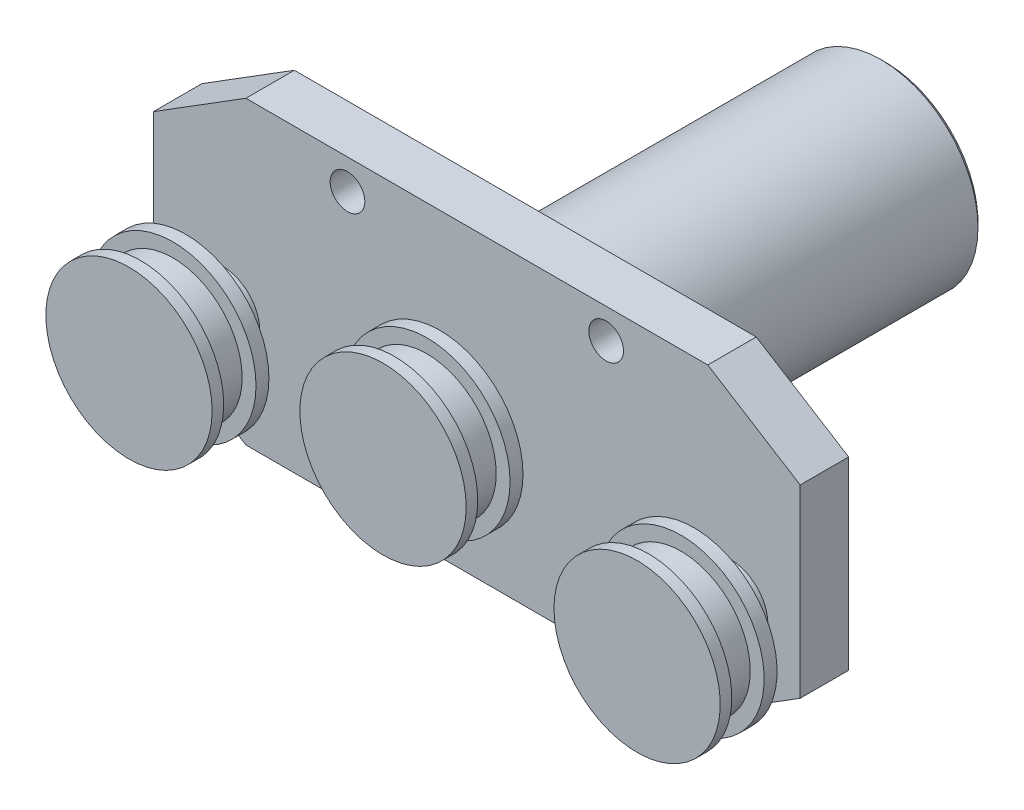
ISO-10303-21;
HEADER;
FILE_DESCRIPTION(('STEP AP214'),'2;1');
FILE_NAME('part.step','',(''),(''),'','','');
FILE_SCHEMA(('AUTOMOTIVE_DESIGN { 1 0 10303 214 1 1 1 1 }'));
ENDSEC;
DATA;
#1=APPLICATION_CONTEXT('core data for automotive mechanical design processes');
#2=APPLICATION_PROTOCOL_DEFINITION('international standard','automotive_design',2000,#1);
#3=PRODUCT_CONTEXT('',#1,'mechanical');
#4=PRODUCT('Part','Part','',(#3));
#5=PRODUCT_RELATED_PRODUCT_CATEGORY('part','',(#4));
#6=PRODUCT_DEFINITION_FORMATION('','',#4);
#7=PRODUCT_DEFINITION_CONTEXT('part definition',#1,'design');
#8=PRODUCT_DEFINITION('design','',#6,#7);
#9=PRODUCT_DEFINITION_SHAPE('','',#8);
#10=(LENGTH_UNIT() NAMED_UNIT(*) SI_UNIT(.MILLI.,.METRE.));
#11=(NAMED_UNIT(*) PLANE_ANGLE_UNIT() SI_UNIT($,.RADIAN.));
#12=(NAMED_UNIT(*) SI_UNIT($,.STERADIAN.) SOLID_ANGLE_UNIT());
#13=UNCERTAINTY_MEASURE_WITH_UNIT(LENGTH_MEASURE(1.E-05),#10,'distance_accuracy_value','');
#14=(GEOMETRIC_REPRESENTATION_CONTEXT(3) GLOBAL_UNCERTAINTY_ASSIGNED_CONTEXT((#13)) GLOBAL_UNIT_ASSIGNED_CONTEXT((#10,
#11,#12)) REPRESENTATION_CONTEXT('',''));
#15=CARTESIAN_POINT('',(0.,0.,0.));
#16=DIRECTION('',(0.,0.,1.));
#17=DIRECTION('',(1.,0.,0.));
#18=AXIS2_PLACEMENT_3D('',#15,#16,#17);
#19=CARTESIAN_POINT('',(-30.,-9.49999999999998,30.8));
#20=DIRECTION('',(0.,0.,-1.));
#21=DIRECTION('',(-1.,0.,0.));
#22=AXIS2_PLACEMENT_3D('',#19,#20,#21);
#23=CYLINDRICAL_SURFACE('',#22,18.);
#24=CARTESIAN_POINT('',(-30.,-9.49999999999998,18.5));
#25=DIRECTION('',(0.,0.,1.));
#26=DIRECTION('',(1.,0.,0.));
#27=AXIS2_PLACEMENT_3D('',#24,#25,#26);
#28=CIRCLE('',#27,18.);
#29=CARTESIAN_POINT('',(-12.,-9.49999999999998,18.5));
#30=VERTEX_POINT('',#29);
#31=EDGE_CURVE('E347',#30,#30,#28,.T.);
#32=ORIENTED_EDGE('',*,*,#31,.T.);
#33=EDGE_LOOP('',(#32));
#34=FACE_BOUND('',#33,.T.);
#35=CARTESIAN_POINT('',(-30.,-9.49999999999998,21.3));
#36=DIRECTION('',(0.,0.,1.));
#37=DIRECTION('',(1.,0.,0.));
#38=AXIS2_PLACEMENT_3D('',#35,#36,#37);
#39=CIRCLE('',#38,18.);
#40=CARTESIAN_POINT('',(-12.,-9.49999999999998,21.3));
#41=VERTEX_POINT('',#40);
#42=EDGE_CURVE('E260',#41,#41,#39,.T.);
#43=ORIENTED_EDGE('',*,*,#42,.F.);
#44=EDGE_LOOP('',(#43));
#45=FACE_BOUND('',#44,.T.);
#46=ADVANCED_FACE('F48',(#34,#45),#23,.T.);
#47=CARTESIAN_POINT('',(25.,0.,30.8));
#48=DIRECTION('',(0.,0.,-1.));
#49=DIRECTION('',(-1.,0.,0.));
#50=AXIS2_PLACEMENT_3D('',#47,#48,#49);
#51=CYLINDRICAL_SURFACE('',#50,18.);
#52=CARTESIAN_POINT('',(25.,0.,18.5));
#53=DIRECTION('',(0.,0.,1.));
#54=DIRECTION('',(1.,0.,0.));
#55=AXIS2_PLACEMENT_3D('',#52,#53,#54);
#56=CIRCLE('',#55,18.);
#57=CARTESIAN_POINT('',(43.,0.,18.5));
#58=VERTEX_POINT('',#57);
#59=EDGE_CURVE('E351',#58,#58,#56,.T.);
#60=ORIENTED_EDGE('',*,*,#59,.T.);
#61=EDGE_LOOP('',(#60));
#62=FACE_BOUND('',#61,.T.);
#63=CARTESIAN_POINT('',(25.,0.,21.3));
#64=DIRECTION('',(0.,0.,1.));
#65=DIRECTION('',(1.,0.,0.));
#66=AXIS2_PLACEMENT_3D('',#63,#64,#65);
#67=CIRCLE('',#66,18.);
#68=CARTESIAN_POINT('',(43.,0.,21.3));
#69=VERTEX_POINT('',#68);
#70=EDGE_CURVE('E256',#69,#69,#67,.T.);
#71=ORIENTED_EDGE('',*,*,#70,.F.);
#72=EDGE_LOOP('',(#71));
#73=FACE_BOUND('',#72,.T.);
#74=ADVANCED_FACE('F311',(#62,#73),#51,.T.);
#75=CARTESIAN_POINT('',(-3.00000000000001,-26.,10.5));
#76=DIRECTION('',(0.,0.,-1.));
#77=DIRECTION('',(-1.,0.,0.));
#78=AXIS2_PLACEMENT_3D('',#75,#76,#77);
#79=CYLINDRICAL_SURFACE('',#78,2.25);
#80=CARTESIAN_POINT('',(-3.00000000000001,-26.,0.));
#81=DIRECTION('',(0.,0.,1.));
#82=DIRECTION('',(1.,0.,0.));
#83=AXIS2_PLACEMENT_3D('',#80,#81,#82);
#84=CIRCLE('',#83,2.25);
#85=CARTESIAN_POINT('',(-0.750000000000005,-26.,0.));
#86=VERTEX_POINT('',#85);
#87=EDGE_CURVE('E195',#86,#86,#84,.F.);
#88=ORIENTED_EDGE('',*,*,#87,.T.);
#89=EDGE_LOOP('',(#88));
#90=FACE_BOUND('',#89,.T.);
#91=CARTESIAN_POINT('',(-3.00000000000001,-26.,4.5));
#92=DIRECTION('',(0.,0.,1.));
#93=DIRECTION('',(1.,0.,0.));
#94=AXIS2_PLACEMENT_3D('',#91,#92,#93);
#95=CIRCLE('',#94,2.25);
#96=CARTESIAN_POINT('',(-0.750000000000005,-26.,4.5));
#97=VERTEX_POINT('',#96);
#98=EDGE_CURVE('E241',#97,#97,#95,.F.);
#99=ORIENTED_EDGE('',*,*,#98,.F.);
#100=EDGE_LOOP('',(#99));
#101=FACE_BOUND('',#100,.T.);
#102=ADVANCED_FACE('F319',(#90,#101),#79,.F.);
#103=CARTESIAN_POINT('',(53.,26.,10.5));
#104=DIRECTION('',(0.,0.,-1.));
#105=DIRECTION('',(-1.,0.,0.));
#106=AXIS2_PLACEMENT_3D('',#103,#104,#105);
#107=CYLINDRICAL_SURFACE('',#106,2.25);
#108=CARTESIAN_POINT('',(53.,26.,0.));
#109=DIRECTION('',(0.,0.,-1.));
#110=DIRECTION('',(-1.,0.,0.));
#111=AXIS2_PLACEMENT_3D('',#108,#109,#110);
#112=CIRCLE('',#111,2.25);
#113=CARTESIAN_POINT('',(50.75,26.,0.));
#114=VERTEX_POINT('',#113);
#115=EDGE_CURVE('E158',#114,#114,#112,.T.);
#116=ORIENTED_EDGE('',*,*,#115,.T.);
#117=EDGE_LOOP('',(#116));
#118=FACE_BOUND('',#117,.T.);
#119=CARTESIAN_POINT('',(53.,26.,4.5));
#120=DIRECTION('',(0.,0.,1.));
#121=DIRECTION('',(1.,0.,0.));
#122=AXIS2_PLACEMENT_3D('',#119,#120,#121);
#123=CIRCLE('',#122,2.25);
#124=CARTESIAN_POINT('',(55.25,26.,4.5));
#125=VERTEX_POINT('',#124);
#126=EDGE_CURVE('E236',#125,#125,#123,.F.);
#127=ORIENTED_EDGE('',*,*,#126,.F.);
#128=EDGE_LOOP('',(#127));
#129=FACE_BOUND('',#128,.T.);
#130=ADVANCED_FACE('F427',(#118,#129),#107,.F.);
#131=CARTESIAN_POINT('',(0.,32.5,10.5));
#132=DIRECTION('',(0.,1.,0.));
#133=DIRECTION('',(0.,0.,1.));
#134=AXIS2_PLACEMENT_3D('',#131,#132,#133);
#135=PLANE('',#134);
#136=DIRECTION('',(1.,0.,0.));
#137=VECTOR('',#136,1.);
#138=CARTESIAN_POINT('',(0.,32.5,0.));
#139=LINE('',#138,#137);
#140=CARTESIAN_POINT('',(-25.,32.5,0.));
#141=VERTEX_POINT('',#140);
#142=CARTESIAN_POINT('',(75.,32.5,0.));
#143=VERTEX_POINT('',#142);
#144=EDGE_CURVE('E145',#141,#143,#139,.T.);
#145=ORIENTED_EDGE('',*,*,#144,.F.);
#146=DIRECTION('',(0.,0.,-1.));
#147=VECTOR('',#146,1.);
#148=CARTESIAN_POINT('',(-25.,32.5,10.5));
#149=LINE('',#148,#147);
#150=CARTESIAN_POINT('',(-25.,32.5,10.5));
#151=VERTEX_POINT('',#150);
#152=EDGE_CURVE('E98',#151,#141,#149,.T.);
#153=ORIENTED_EDGE('',*,*,#152,.F.);
#154=DIRECTION('',(1.,0.,0.));
#155=VECTOR('',#154,1.);
#156=CARTESIAN_POINT('',(0.,32.5,10.5));
#157=LINE('',#156,#155);
#158=CARTESIAN_POINT('',(75.,32.5,10.5));
#159=VERTEX_POINT('',#158);
#160=EDGE_CURVE('E191',#151,#159,#157,.T.);
#161=ORIENTED_EDGE('',*,*,#160,.T.);
#162=DIRECTION('',(0.,0.,-1.));
#163=VECTOR('',#162,1.);
#164=CARTESIAN_POINT('',(75.,32.5,10.5));
#165=LINE('',#164,#163);
#166=EDGE_CURVE('E167',#159,#143,#165,.T.);
#167=ORIENTED_EDGE('',*,*,#166,.T.);
#168=EDGE_LOOP('',(#145,#153,#161,#167));
#169=FACE_BOUND('',#168,.T.);
#170=ADVANCED_FACE('F440',(#169),#135,.T.);
#171=CARTESIAN_POINT('',(-21.6292134831461,34.6067415730337,10.5));
#172=DIRECTION('',(0.52999894000318,-0.847998304005088,0.));
#173=DIRECTION('',(0.847998304005088,0.52999894000318,0.));
#174=AXIS2_PLACEMENT_3D('',#171,#172,#173);
#175=PLANE('',#174);
#176=DIRECTION('',(-0.847998304005088,-0.52999894000318,0.));
#177=VECTOR('',#176,1.);
#178=CARTESIAN_POINT('',(-21.6292134831461,34.6067415730337,0.));
#179=LINE('',#178,#177);
#180=CARTESIAN_POINT('',(-45.,20.,0.));
#181=VERTEX_POINT('',#180);
#182=EDGE_CURVE('E205',#141,#181,#179,.T.);
#183=ORIENTED_EDGE('',*,*,#182,.T.);
#184=DIRECTION('',(0.,0.,-1.));
#185=VECTOR('',#184,1.);
#186=CARTESIAN_POINT('',(-45.,20.,10.5));
#187=LINE('',#186,#185);
#188=CARTESIAN_POINT('',(-45.,20.,10.5));
#189=VERTEX_POINT('',#188);
#190=EDGE_CURVE('E226',#189,#181,#187,.T.);
#191=ORIENTED_EDGE('',*,*,#190,.F.);
#192=DIRECTION('',(-0.847998304005088,-0.52999894000318,0.));
#193=VECTOR('',#192,1.);
#194=CARTESIAN_POINT('',(-21.6292134831461,34.6067415730337,10.5));
#195=LINE('',#194,#193);
#196=EDGE_CURVE('E194',#151,#189,#195,.T.);
#197=ORIENTED_EDGE('',*,*,#196,.F.);
#198=ORIENTED_EDGE('',*,*,#152,.T.);
#199=EDGE_LOOP('',(#183,#191,#197,#198));
#200=FACE_BOUND('',#199,.T.);
#201=ADVANCED_FACE('F438',(#200),#175,.F.);
#202=CARTESIAN_POINT('',(-45.,0.,10.5));
#203=DIRECTION('',(1.,0.,0.));
#204=DIRECTION('',(0.,0.,-1.));
#205=AXIS2_PLACEMENT_3D('',#202,#203,#204);
#206=PLANE('',#205);
#207=DIRECTION('',(0.,-1.,0.));
#208=VECTOR('',#207,1.);
#209=CARTESIAN_POINT('',(-45.,0.,0.));
#210=LINE('',#209,#208);
#211=CARTESIAN_POINT('',(-45.,-20.,0.));
#212=VERTEX_POINT('',#211);
#213=EDGE_CURVE('E85',#181,#212,#210,.T.);
#214=ORIENTED_EDGE('',*,*,#213,.T.);
#215=DIRECTION('',(0.,0.,-1.));
#216=VECTOR('',#215,1.);
#217=CARTESIAN_POINT('',(-45.,-20.,10.5));
#218=LINE('',#217,#216);
#219=CARTESIAN_POINT('',(-45.,-20.,10.5));
#220=VERTEX_POINT('',#219);
#221=EDGE_CURVE('E223',#220,#212,#218,.T.);
#222=ORIENTED_EDGE('',*,*,#221,.F.);
#223=DIRECTION('',(0.,-1.,0.));
#224=VECTOR('',#223,1.);
#225=CARTESIAN_POINT('',(-45.,0.,10.5));
#226=LINE('',#225,#224);
#227=EDGE_CURVE('E198',#189,#220,#226,.T.);
#228=ORIENTED_EDGE('',*,*,#227,.F.);
#229=ORIENTED_EDGE('',*,*,#190,.T.);
#230=EDGE_LOOP('',(#214,#222,#228,#229));
#231=FACE_BOUND('',#230,.T.);
#232=ADVANCED_FACE('F435',(#231),#206,.F.);
#233=CARTESIAN_POINT('',(-21.6292134831461,-34.6067415730337,10.5));
#234=DIRECTION('',(0.52999894000318,0.847998304005088,0.));
#235=DIRECTION('',(-0.847998304005088,0.52999894000318,0.));
#236=AXIS2_PLACEMENT_3D('',#233,#234,#235);
#237=PLANE('',#236);
#238=DIRECTION('',(0.847998304005088,-0.52999894000318,0.));
#239=VECTOR('',#238,1.);
#240=CARTESIAN_POINT('',(-21.6292134831461,-34.6067415730337,0.));
#241=LINE('',#240,#239);
#242=CARTESIAN_POINT('',(-25.,-32.5,0.));
#243=VERTEX_POINT('',#242);
#244=EDGE_CURVE('E91',#212,#243,#241,.T.);
#245=ORIENTED_EDGE('',*,*,#244,.T.);
#246=DIRECTION('',(0.,0.,-1.));
#247=VECTOR('',#246,1.);
#248=CARTESIAN_POINT('',(-25.,-32.5,10.5));
#249=LINE('',#248,#247);
#250=CARTESIAN_POINT('',(-25.,-32.5,10.5));
#251=VERTEX_POINT('',#250);
#252=EDGE_CURVE('E134',#251,#243,#249,.T.);
#253=ORIENTED_EDGE('',*,*,#252,.F.);
#254=DIRECTION('',(0.847998304005088,-0.52999894000318,0.));
#255=VECTOR('',#254,1.);
#256=CARTESIAN_POINT('',(-21.6292134831461,-34.6067415730337,10.5));
#257=LINE('',#256,#255);
#258=EDGE_CURVE('E67',#220,#251,#257,.T.);
#259=ORIENTED_EDGE('',*,*,#258,.F.);
#260=ORIENTED_EDGE('',*,*,#221,.T.);
#261=EDGE_LOOP('',(#245,#253,#259,#260));
#262=FACE_BOUND('',#261,.T.);
#263=ADVANCED_FACE('F432',(#262),#237,.F.);
#264=CARTESIAN_POINT('',(0.,-32.5,10.5));
#265=DIRECTION('',(0.,1.,0.));
#266=DIRECTION('',(0.,0.,1.));
#267=AXIS2_PLACEMENT_3D('',#264,#265,#266);
#268=PLANE('',#267);
#269=DIRECTION('',(1.,0.,0.));
#270=VECTOR('',#269,1.);
#271=CARTESIAN_POINT('',(0.,-32.5,0.));
#272=LINE('',#271,#270);
#273=CARTESIAN_POINT('',(75.,-32.5,0.));
#274=VERTEX_POINT('',#273);
#275=EDGE_CURVE('E140',#243,#274,#272,.T.);
#276=ORIENTED_EDGE('',*,*,#275,.T.);
#277=DIRECTION('',(0.,0.,-1.));
#278=VECTOR('',#277,1.);
#279=CARTESIAN_POINT('',(75.,-32.5,10.5));
#280=LINE('',#279,#278);
#281=CARTESIAN_POINT('',(75.,-32.5,10.5));
#282=VERTEX_POINT('',#281);
#283=EDGE_CURVE('E137',#282,#274,#280,.T.);
#284=ORIENTED_EDGE('',*,*,#283,.F.);
#285=DIRECTION('',(1.,0.,0.));
#286=VECTOR('',#285,1.);
#287=CARTESIAN_POINT('',(0.,-32.5,10.5));
#288=LINE('',#287,#286);
#289=EDGE_CURVE('E124',#251,#282,#288,.T.);
#290=ORIENTED_EDGE('',*,*,#289,.F.);
#291=ORIENTED_EDGE('',*,*,#252,.T.);
#292=EDGE_LOOP('',(#276,#284,#290,#291));
#293=FACE_BOUND('',#292,.T.);
#294=ADVANCED_FACE('F138',(#293),#268,.F.);
#295=CARTESIAN_POINT('',(-3.00000000000001,26.,10.5));
#296=DIRECTION('',(0.,0.,-1.));
#297=DIRECTION('',(-1.,0.,0.));
#298=AXIS2_PLACEMENT_3D('',#295,#296,#297);
#299=CYLINDRICAL_SURFACE('',#298,2.25);
#300=CARTESIAN_POINT('',(-3.00000000000001,26.,4.5));
#301=DIRECTION('',(0.,0.,-1.));
#302=DIRECTION('',(-1.,0.,0.));
#303=AXIS2_PLACEMENT_3D('',#300,#301,#302);
#304=CIRCLE('',#303,2.25);
#305=CARTESIAN_POINT('',(-5.25000000000002,26.,4.5));
#306=VERTEX_POINT('',#305);
#307=EDGE_CURVE('E245',#306,#306,#304,.T.);
#308=ORIENTED_EDGE('',*,*,#307,.F.);
#309=EDGE_LOOP('',(#308));
#310=FACE_BOUND('',#309,.T.);
#311=CARTESIAN_POINT('',(-3.00000000000001,26.,0.));
#312=DIRECTION('',(0.,0.,1.));
#313=DIRECTION('',(1.,0.,0.));
#314=AXIS2_PLACEMENT_3D('',#311,#312,#313);
#315=CIRCLE('',#314,2.25);
#316=CARTESIAN_POINT('',(-0.750000000000005,26.,0.));
#317=VERTEX_POINT('',#316);
#318=EDGE_CURVE('E214',#317,#317,#315,.T.);
#319=ORIENTED_EDGE('',*,*,#318,.F.);
#320=EDGE_LOOP('',(#319));
#321=FACE_BOUND('',#320,.T.);
#322=ADVANCED_FACE('F413',(#310,#321),#299,.F.);
#323=CARTESIAN_POINT('',(0.,0.,10.5));
#324=DIRECTION('',(0.,0.,1.));
#325=DIRECTION('',(1.,0.,0.));
#326=AXIS2_PLACEMENT_3D('',#323,#324,#325);
#327=PLANE('',#326);
#328=CARTESIAN_POINT('',(53.,-26.,10.5));
#329=DIRECTION('',(0.,0.,1.));
#330=DIRECTION('',(-1.,0.,0.));
#331=AXIS2_PLACEMENT_3D('',#328,#329,#330);
#332=CIRCLE('',#331,3.75);
#333=CARTESIAN_POINT('',(49.25,-26.,10.5));
#334=VERTEX_POINT('',#333);
#335=EDGE_CURVE('E374',#334,#334,#332,.T.);
#336=ORIENTED_EDGE('',*,*,#335,.F.);
#337=EDGE_LOOP('',(#336));
#338=FACE_BOUND('',#337,.T.);
#339=CARTESIAN_POINT('',(53.,26.,10.5));
#340=DIRECTION('',(0.,0.,1.));
#341=DIRECTION('',(1.,0.,0.));
#342=AXIS2_PLACEMENT_3D('',#339,#340,#341);
#343=CIRCLE('',#342,3.75);
#344=CARTESIAN_POINT('',(56.75,26.,10.5));
#345=VERTEX_POINT('',#344);
#346=EDGE_CURVE('E366',#345,#345,#343,.T.);
#347=ORIENTED_EDGE('',*,*,#346,.F.);
#348=EDGE_LOOP('',(#347));
#349=FACE_BOUND('',#348,.T.);
#350=CARTESIAN_POINT('',(-3.00000000000001,26.,10.5));
#351=DIRECTION('',(0.,0.,1.));
#352=DIRECTION('',(-1.,0.,0.));
#353=AXIS2_PLACEMENT_3D('',#350,#351,#352);
#354=CIRCLE('',#353,3.75);
#355=CARTESIAN_POINT('',(-6.75000000000001,26.,10.5));
#356=VERTEX_POINT('',#355);
#357=EDGE_CURVE('E357',#356,#356,#354,.T.);
#358=ORIENTED_EDGE('',*,*,#357,.F.);
#359=EDGE_LOOP('',(#358));
#360=FACE_BOUND('',#359,.T.);
#361=CARTESIAN_POINT('',(-3.00000000000001,-26.,10.5));
#362=DIRECTION('',(0.,0.,1.));
#363=DIRECTION('',(1.,0.,0.));
#364=AXIS2_PLACEMENT_3D('',#361,#362,#363);
#365=CIRCLE('',#364,3.75);
#366=CARTESIAN_POINT('',(0.74999999999999,-26.,10.5));
#367=VERTEX_POINT('',#366);
#368=EDGE_CURVE('E361',#367,#367,#365,.T.);
#369=ORIENTED_EDGE('',*,*,#368,.F.);
#370=EDGE_LOOP('',(#369));
#371=FACE_BOUND('',#370,.T.);
#372=CARTESIAN_POINT('',(80.,-9.49999999999997,10.5));
#373=DIRECTION('',(0.,0.,1.));
#374=DIRECTION('',(-1.,0.,0.));
#375=AXIS2_PLACEMENT_3D('',#372,#373,#374);
#376=CIRCLE('',#375,8.);
#377=CARTESIAN_POINT('',(72.,-9.49999999999997,10.5));
#378=VERTEX_POINT('',#377);
#379=EDGE_CURVE('E397',#378,#378,#376,.T.);
#380=ORIENTED_EDGE('',*,*,#379,.F.);
#381=EDGE_LOOP('',(#380));
#382=FACE_BOUND('',#381,.T.);
#383=CARTESIAN_POINT('',(-30.,-9.49999999999998,10.5));
#384=DIRECTION('',(0.,0.,1.));
#385=DIRECTION('',(1.,0.,0.));
#386=AXIS2_PLACEMENT_3D('',#383,#384,#385);
#387=CIRCLE('',#386,8.);
#388=CARTESIAN_POINT('',(-22.,-9.49999999999998,10.5));
#389=VERTEX_POINT('',#388);
#390=EDGE_CURVE('E389',#389,#389,#387,.T.);
#391=ORIENTED_EDGE('',*,*,#390,.F.);
#392=EDGE_LOOP('',(#391));
#393=FACE_BOUND('',#392,.T.);
#394=CARTESIAN_POINT('',(25.,0.,10.5));
#395=DIRECTION('',(0.,0.,1.));
#396=DIRECTION('',(1.,0.,0.));
#397=AXIS2_PLACEMENT_3D('',#394,#395,#396);
#398=CIRCLE('',#397,6.50000000000001);
#399=CARTESIAN_POINT('',(31.5,0.,10.5));
#400=VERTEX_POINT('',#399);
#401=EDGE_CURVE('E161',#400,#400,#398,.T.);
#402=ORIENTED_EDGE('',*,*,#401,.F.);
#403=EDGE_LOOP('',(#402));
#404=FACE_BOUND('',#403,.T.);
#405=ORIENTED_EDGE('',*,*,#160,.F.);
#406=ORIENTED_EDGE('',*,*,#196,.T.);
#407=ORIENTED_EDGE('',*,*,#227,.T.);
#408=ORIENTED_EDGE('',*,*,#258,.T.);
#409=ORIENTED_EDGE('',*,*,#289,.T.);
#410=DIRECTION('',(-0.847998304005088,-0.52999894000318,0.));
#411=VECTOR('',#410,1.);
#412=CARTESIAN_POINT('',(71.6292134831461,-34.6067415730337,10.5));
#413=LINE('',#412,#411);
#414=CARTESIAN_POINT('',(95.,-20.,10.5));
#415=VERTEX_POINT('',#414);
#416=EDGE_CURVE('E130',#415,#282,#413,.T.);
#417=ORIENTED_EDGE('',*,*,#416,.F.);
#418=DIRECTION('',(0.,-1.,0.));
#419=VECTOR('',#418,1.);
#420=CARTESIAN_POINT('',(95.,0.,10.5));
#421=LINE('',#420,#419);
#422=CARTESIAN_POINT('',(95.,20.,10.5));
#423=VERTEX_POINT('',#422);
#424=EDGE_CURVE('E150',#423,#415,#421,.T.);
#425=ORIENTED_EDGE('',*,*,#424,.F.);
#426=DIRECTION('',(0.847998304005088,-0.52999894000318,0.));
#427=VECTOR('',#426,1.);
#428=CARTESIAN_POINT('',(71.629213483146,34.6067415730337,10.5));
#429=LINE('',#428,#427);
#430=EDGE_CURVE('E155',#159,#423,#429,.T.);
#431=ORIENTED_EDGE('',*,*,#430,.F.);
#432=EDGE_LOOP('',(#405,#406,#407,#408,#409,#417,#425,#431));
#433=FACE_BOUND('',#432,.T.);
#434=ADVANCED_FACE('F127',(#338,#349,#360,#371,#382,#393,#404,#433),#327,.T.);
#435=CARTESIAN_POINT('',(0.,0.,0.));
#436=DIRECTION('',(0.,0.,1.));
#437=DIRECTION('',(1.,0.,0.));
#438=AXIS2_PLACEMENT_3D('',#435,#436,#437);
#439=PLANE('',#438);
#440=CARTESIAN_POINT('',(80.,-9.49999999999997,0.));
#441=DIRECTION('',(0.,0.,1.));
#442=DIRECTION('',(1.,0.,0.));
#443=AXIS2_PLACEMENT_3D('',#440,#441,#442);
#444=CIRCLE('',#443,2.);
#445=CARTESIAN_POINT('',(82.,-9.49999999999997,0.));
#446=VERTEX_POINT('',#445);
#447=EDGE_CURVE('E11',#446,#446,#444,.F.);
#448=ORIENTED_EDGE('',*,*,#447,.F.);
#449=EDGE_LOOP('',(#448));
#450=FACE_BOUND('',#449,.T.);
#451=CARTESIAN_POINT('',(-30.,-9.49999999999998,0.));
#452=DIRECTION('',(0.,0.,1.));
#453=DIRECTION('',(1.,0.,0.));
#454=AXIS2_PLACEMENT_3D('',#451,#452,#453);
#455=CIRCLE('',#454,2.00000000000001);
#456=CARTESIAN_POINT('',(-28.,-9.49999999999998,0.));
#457=VERTEX_POINT('',#456);
#458=EDGE_CURVE('E59',#457,#457,#455,.F.);
#459=ORIENTED_EDGE('',*,*,#458,.F.);
#460=EDGE_LOOP('',(#459));
#461=FACE_BOUND('',#460,.T.);
#462=CARTESIAN_POINT('',(25.,0.,0.));
#463=DIRECTION('',(0.,0.,-1.));
#464=DIRECTION('',(-1.,0.,0.));
#465=AXIS2_PLACEMENT_3D('',#462,#463,#464);
#466=CIRCLE('',#465,21.);
#467=CARTESIAN_POINT('',(4.,0.,0.));
#468=VERTEX_POINT('',#467);
#469=EDGE_CURVE('E231',#468,#468,#466,.T.);
#470=ORIENTED_EDGE('',*,*,#469,.F.);
#471=EDGE_LOOP('',(#470));
#472=FACE_BOUND('',#471,.T.);
#473=ORIENTED_EDGE('',*,*,#144,.T.);
#474=DIRECTION('',(0.847998304005088,-0.52999894000318,0.));
#475=VECTOR('',#474,1.);
#476=CARTESIAN_POINT('',(71.629213483146,34.6067415730337,0.));
#477=LINE('',#476,#475);
#478=CARTESIAN_POINT('',(95.,20.,0.));
#479=VERTEX_POINT('',#478);
#480=EDGE_CURVE('E176',#143,#479,#477,.T.);
#481=ORIENTED_EDGE('',*,*,#480,.T.);
#482=DIRECTION('',(0.,-1.,0.));
#483=VECTOR('',#482,1.);
#484=CARTESIAN_POINT('',(95.,0.,0.));
#485=LINE('',#484,#483);
#486=CARTESIAN_POINT('',(95.,-20.,0.));
#487=VERTEX_POINT('',#486);
#488=EDGE_CURVE('E171',#479,#487,#485,.T.);
#489=ORIENTED_EDGE('',*,*,#488,.T.);
#490=DIRECTION('',(-0.847998304005088,-0.52999894000318,0.));
#491=VECTOR('',#490,1.);
#492=CARTESIAN_POINT('',(71.6292134831461,-34.6067415730337,0.));
#493=LINE('',#492,#491);
#494=EDGE_CURVE('E168',#487,#274,#493,.T.);
#495=ORIENTED_EDGE('',*,*,#494,.T.);
#496=ORIENTED_EDGE('',*,*,#275,.F.);
#497=ORIENTED_EDGE('',*,*,#244,.F.);
#498=ORIENTED_EDGE('',*,*,#213,.F.);
#499=ORIENTED_EDGE('',*,*,#182,.F.);
#500=EDGE_LOOP('',(#473,#481,#489,#495,#496,#497,#498,#499));
#501=FACE_BOUND('',#500,.T.);
#502=ORIENTED_EDGE('',*,*,#318,.T.);
#503=EDGE_LOOP('',(#502));
#504=FACE_BOUND('',#503,.T.);
#505=ORIENTED_EDGE('',*,*,#87,.F.);
#506=EDGE_LOOP('',(#505));
#507=FACE_BOUND('',#506,.T.);
#508=ORIENTED_EDGE('',*,*,#115,.F.);
#509=EDGE_LOOP('',(#508));
#510=FACE_BOUND('',#509,.T.);
#511=CARTESIAN_POINT('',(53.,-26.,0.));
#512=DIRECTION('',(0.,0.,-1.));
#513=DIRECTION('',(-1.,0.,0.));
#514=AXIS2_PLACEMENT_3D('',#511,#512,#513);
#515=CIRCLE('',#514,2.25);
#516=CARTESIAN_POINT('',(50.75,-26.,0.));
#517=VERTEX_POINT('',#516);
#518=EDGE_CURVE('E151',#517,#517,#515,.F.);
#519=ORIENTED_EDGE('',*,*,#518,.T.);
#520=EDGE_LOOP('',(#519));
#521=FACE_BOUND('',#520,.T.);
#522=ADVANCED_FACE('F274',(#450,#461,#472,#501,#504,#507,#510,#521),#439,.F.);
#523=CARTESIAN_POINT('',(71.6292134831461,-34.6067415730337,10.5));
#524=DIRECTION('',(0.52999894000318,-0.847998304005088,0.));
#525=DIRECTION('',(0.847998304005088,0.52999894000318,0.));
#526=AXIS2_PLACEMENT_3D('',#523,#524,#525);
#527=PLANE('',#526);
#528=ORIENTED_EDGE('',*,*,#494,.F.);
#529=DIRECTION('',(0.,0.,-1.));
#530=VECTOR('',#529,1.);
#531=CARTESIAN_POINT('',(95.,-20.,10.5));
#532=LINE('',#531,#530);
#533=EDGE_CURVE('E146',#415,#487,#532,.T.);
#534=ORIENTED_EDGE('',*,*,#533,.F.);
#535=ORIENTED_EDGE('',*,*,#416,.T.);
#536=ORIENTED_EDGE('',*,*,#283,.T.);
#537=EDGE_LOOP('',(#528,#534,#535,#536));
#538=FACE_BOUND('',#537,.T.);
#539=ADVANCED_FACE('F148',(#538),#527,.T.);
#540=CARTESIAN_POINT('',(95.,0.,10.5));
#541=DIRECTION('',(1.,0.,0.));
#542=DIRECTION('',(0.,1.,0.));
#543=AXIS2_PLACEMENT_3D('',#540,#541,#542);
#544=PLANE('',#543);
#545=ORIENTED_EDGE('',*,*,#488,.F.);
#546=DIRECTION('',(0.,0.,-1.));
#547=VECTOR('',#546,1.);
#548=CARTESIAN_POINT('',(95.,20.,10.5));
#549=LINE('',#548,#547);
#550=EDGE_CURVE('E186',#423,#479,#549,.T.);
#551=ORIENTED_EDGE('',*,*,#550,.F.);
#552=ORIENTED_EDGE('',*,*,#424,.T.);
#553=ORIENTED_EDGE('',*,*,#533,.T.);
#554=EDGE_LOOP('',(#545,#551,#552,#553));
#555=FACE_BOUND('',#554,.T.);
#556=ADVANCED_FACE('F305',(#555),#544,.T.);
#557=CARTESIAN_POINT('',(71.629213483146,34.6067415730337,10.5));
#558=DIRECTION('',(0.529998940003179,0.847998304005088,0.));
#559=DIRECTION('',(-0.847998304005088,0.52999894000318,0.));
#560=AXIS2_PLACEMENT_3D('',#557,#558,#559);
#561=PLANE('',#560);
#562=ORIENTED_EDGE('',*,*,#480,.F.);
#563=ORIENTED_EDGE('',*,*,#166,.F.);
#564=ORIENTED_EDGE('',*,*,#430,.T.);
#565=ORIENTED_EDGE('',*,*,#550,.T.);
#566=EDGE_LOOP('',(#562,#563,#564,#565));
#567=FACE_BOUND('',#566,.T.);
#568=ADVANCED_FACE('F295',(#567),#561,.T.);
#569=CARTESIAN_POINT('',(53.,-26.,10.5));
#570=DIRECTION('',(0.,0.,-1.));
#571=DIRECTION('',(-1.,0.,0.));
#572=AXIS2_PLACEMENT_3D('',#569,#570,#571);
#573=CYLINDRICAL_SURFACE('',#572,2.25);
#574=CARTESIAN_POINT('',(53.,-26.,4.5));
#575=DIRECTION('',(0.,0.,-1.));
#576=DIRECTION('',(-1.,0.,0.));
#577=AXIS2_PLACEMENT_3D('',#574,#575,#576);
#578=CIRCLE('',#577,2.25);
#579=CARTESIAN_POINT('',(50.75,-26.,4.5));
#580=VERTEX_POINT('',#579);
#581=EDGE_CURVE('E232',#580,#580,#578,.T.);
#582=ORIENTED_EDGE('',*,*,#581,.F.);
#583=EDGE_LOOP('',(#582));
#584=FACE_BOUND('',#583,.T.);
#585=ORIENTED_EDGE('',*,*,#518,.F.);
#586=EDGE_LOOP('',(#585));
#587=FACE_BOUND('',#586,.T.);
#588=ADVANCED_FACE('F292',(#584,#587),#573,.F.);
#589=CARTESIAN_POINT('',(25.,0.,18.5));
#590=DIRECTION('',(0.,0.,-1.));
#591=DIRECTION('',(-1.,0.,0.));
#592=AXIS2_PLACEMENT_3D('',#589,#590,#591);
#593=CYLINDRICAL_SURFACE('',#592,6.50000000000001);
#594=CARTESIAN_POINT('',(25.,0.,18.5));
#595=DIRECTION('',(0.,0.,1.));
#596=DIRECTION('',(1.,0.,0.));
#597=AXIS2_PLACEMENT_3D('',#594,#595,#596);
#598=CIRCLE('',#597,6.50000000000001);
#599=CARTESIAN_POINT('',(31.5,0.,18.5));
#600=VERTEX_POINT('',#599);
#601=EDGE_CURVE('E172',#600,#600,#598,.T.);
#602=ORIENTED_EDGE('',*,*,#601,.F.);
#603=EDGE_LOOP('',(#602));
#604=FACE_BOUND('',#603,.T.);
#605=ORIENTED_EDGE('',*,*,#401,.T.);
#606=EDGE_LOOP('',(#605));
#607=FACE_BOUND('',#606,.T.);
#608=ADVANCED_FACE('F294',(#604,#607),#593,.T.);
#609=CARTESIAN_POINT('',(-30.,-9.49999999999998,18.5));
#610=DIRECTION('',(0.,0.,-1.));
#611=DIRECTION('',(-1.,0.,0.));
#612=AXIS2_PLACEMENT_3D('',#609,#610,#611);
#613=CYLINDRICAL_SURFACE('',#612,8.);
#614=CARTESIAN_POINT('',(-30.,-9.49999999999998,18.5));
#615=DIRECTION('',(0.,0.,1.));
#616=DIRECTION('',(1.,0.,0.));
#617=AXIS2_PLACEMENT_3D('',#614,#615,#616);
#618=CIRCLE('',#617,8.);
#619=CARTESIAN_POINT('',(-22.,-9.49999999999998,18.5));
#620=VERTEX_POINT('',#619);
#621=EDGE_CURVE('E393',#620,#620,#618,.T.);
#622=ORIENTED_EDGE('',*,*,#621,.F.);
#623=EDGE_LOOP('',(#622));
#624=FACE_BOUND('',#623,.T.);
#625=ORIENTED_EDGE('',*,*,#390,.T.);
#626=EDGE_LOOP('',(#625));
#627=FACE_BOUND('',#626,.T.);
#628=ADVANCED_FACE('F302',(#624,#627),#613,.T.);
#629=CARTESIAN_POINT('',(80.,-9.49999999999997,18.5));
#630=DIRECTION('',(0.,0.,-1.));
#631=DIRECTION('',(-1.,0.,0.));
#632=AXIS2_PLACEMENT_3D('',#629,#630,#631);
#633=CYLINDRICAL_SURFACE('',#632,8.);
#634=CARTESIAN_POINT('',(80.,-9.49999999999997,18.5));
#635=DIRECTION('',(0.,0.,1.));
#636=DIRECTION('',(-1.,0.,0.));
#637=AXIS2_PLACEMENT_3D('',#634,#635,#636);
#638=CIRCLE('',#637,8.);
#639=CARTESIAN_POINT('',(72.,-9.49999999999997,18.5));
#640=VERTEX_POINT('',#639);
#641=EDGE_CURVE('E249',#640,#640,#638,.T.);
#642=ORIENTED_EDGE('',*,*,#641,.F.);
#643=EDGE_LOOP('',(#642));
#644=FACE_BOUND('',#643,.T.);
#645=ORIENTED_EDGE('',*,*,#379,.T.);
#646=EDGE_LOOP('',(#645));
#647=FACE_BOUND('',#646,.T.);
#648=ADVANCED_FACE('F857',(#644,#647),#633,.T.);
#649=CARTESIAN_POINT('',(53.,-26.,4.5));
#650=DIRECTION('',(0.,0.,1.));
#651=DIRECTION('',(1.,0.,0.));
#652=AXIS2_PLACEMENT_3D('',#649,#650,#651);
#653=CYLINDRICAL_SURFACE('',#652,3.75);
#654=CARTESIAN_POINT('',(53.,-26.,4.5));
#655=DIRECTION('',(0.,0.,1.));
#656=DIRECTION('',(-1.,0.,0.));
#657=AXIS2_PLACEMENT_3D('',#654,#655,#656);
#658=CIRCLE('',#657,3.75);
#659=CARTESIAN_POINT('',(49.25,-26.,4.5));
#660=VERTEX_POINT('',#659);
#661=EDGE_CURVE('E378',#660,#660,#658,.T.);
#662=ORIENTED_EDGE('',*,*,#661,.F.);
#663=EDGE_LOOP('',(#662));
#664=FACE_BOUND('',#663,.T.);
#665=ORIENTED_EDGE('',*,*,#335,.T.);
#666=EDGE_LOOP('',(#665));
#667=FACE_BOUND('',#666,.T.);
#668=ADVANCED_FACE('F847',(#664,#667),#653,.F.);
#669=CARTESIAN_POINT('',(53.,-26.,4.5));
#670=DIRECTION('',(0.,0.,-1.));
#671=DIRECTION('',(-1.,0.,0.));
#672=AXIS2_PLACEMENT_3D('',#669,#670,#671);
#673=PLANE('',#672);
#674=ORIENTED_EDGE('',*,*,#581,.T.);
#675=EDGE_LOOP('',(#674));
#676=FACE_BOUND('',#675,.T.);
#677=ORIENTED_EDGE('',*,*,#661,.T.);
#678=EDGE_LOOP('',(#677));
#679=FACE_BOUND('',#678,.T.);
#680=ADVANCED_FACE('F837',(#676,#679),#673,.F.);
#681=CARTESIAN_POINT('',(53.,26.,4.5));
#682=DIRECTION('',(0.,0.,1.));
#683=DIRECTION('',(1.,0.,0.));
#684=AXIS2_PLACEMENT_3D('',#681,#682,#683);
#685=PLANE('',#684);
#686=CARTESIAN_POINT('',(53.,26.,4.5));
#687=DIRECTION('',(0.,0.,1.));
#688=DIRECTION('',(1.,0.,0.));
#689=AXIS2_PLACEMENT_3D('',#686,#687,#688);
#690=CIRCLE('',#689,3.75);
#691=CARTESIAN_POINT('',(56.75,26.,4.5));
#692=VERTEX_POINT('',#691);
#693=EDGE_CURVE('E370',#692,#692,#690,.T.);
#694=ORIENTED_EDGE('',*,*,#693,.T.);
#695=EDGE_LOOP('',(#694));
#696=FACE_BOUND('',#695,.T.);
#697=ORIENTED_EDGE('',*,*,#126,.T.);
#698=EDGE_LOOP('',(#697));
#699=FACE_BOUND('',#698,.T.);
#700=ADVANCED_FACE('F827',(#696,#699),#685,.T.);
#701=CARTESIAN_POINT('',(53.,26.,4.5));
#702=DIRECTION('',(0.,0.,1.));
#703=DIRECTION('',(1.,0.,0.));
#704=AXIS2_PLACEMENT_3D('',#701,#702,#703);
#705=CYLINDRICAL_SURFACE('',#704,3.75);
#706=ORIENTED_EDGE('',*,*,#693,.F.);
#707=EDGE_LOOP('',(#706));
#708=FACE_BOUND('',#707,.T.);
#709=ORIENTED_EDGE('',*,*,#346,.T.);
#710=EDGE_LOOP('',(#709));
#711=FACE_BOUND('',#710,.T.);
#712=ADVANCED_FACE('F817',(#708,#711),#705,.F.);
#713=CARTESIAN_POINT('',(-3.00000000000001,-26.,4.5));
#714=DIRECTION('',(0.,0.,1.));
#715=DIRECTION('',(1.,0.,0.));
#716=AXIS2_PLACEMENT_3D('',#713,#714,#715);
#717=PLANE('',#716);
#718=CARTESIAN_POINT('',(-3.00000000000001,-26.,4.5));
#719=DIRECTION('',(0.,0.,1.));
#720=DIRECTION('',(1.,0.,0.));
#721=AXIS2_PLACEMENT_3D('',#718,#719,#720);
#722=CIRCLE('',#721,3.75);
#723=CARTESIAN_POINT('',(0.74999999999999,-26.,4.5));
#724=VERTEX_POINT('',#723);
#725=EDGE_CURVE('E237',#724,#724,#722,.T.);
#726=ORIENTED_EDGE('',*,*,#725,.T.);
#727=EDGE_LOOP('',(#726));
#728=FACE_BOUND('',#727,.T.);
#729=ORIENTED_EDGE('',*,*,#98,.T.);
#730=EDGE_LOOP('',(#729));
#731=FACE_BOUND('',#730,.T.);
#732=ADVANCED_FACE('F807',(#728,#731),#717,.T.);
#733=CARTESIAN_POINT('',(-3.00000000000001,-26.,4.5));
#734=DIRECTION('',(0.,0.,1.));
#735=DIRECTION('',(1.,0.,0.));
#736=AXIS2_PLACEMENT_3D('',#733,#734,#735);
#737=CYLINDRICAL_SURFACE('',#736,3.75);
#738=ORIENTED_EDGE('',*,*,#725,.F.);
#739=EDGE_LOOP('',(#738));
#740=FACE_BOUND('',#739,.T.);
#741=ORIENTED_EDGE('',*,*,#368,.T.);
#742=EDGE_LOOP('',(#741));
#743=FACE_BOUND('',#742,.T.);
#744=ADVANCED_FACE('F797',(#740,#743),#737,.F.);
#745=CARTESIAN_POINT('',(-3.00000000000001,26.,4.5));
#746=DIRECTION('',(0.,0.,1.));
#747=DIRECTION('',(1.,0.,0.));
#748=AXIS2_PLACEMENT_3D('',#745,#746,#747);
#749=CYLINDRICAL_SURFACE('',#748,3.75);
#750=CARTESIAN_POINT('',(-3.00000000000001,26.,4.5));
#751=DIRECTION('',(0.,0.,1.));
#752=DIRECTION('',(-1.,0.,0.));
#753=AXIS2_PLACEMENT_3D('',#750,#751,#752);
#754=CIRCLE('',#753,3.75);
#755=CARTESIAN_POINT('',(-6.75000000000001,26.,4.5));
#756=VERTEX_POINT('',#755);
#757=EDGE_CURVE('E362',#756,#756,#754,.T.);
#758=ORIENTED_EDGE('',*,*,#757,.F.);
#759=EDGE_LOOP('',(#758));
#760=FACE_BOUND('',#759,.T.);
#761=ORIENTED_EDGE('',*,*,#357,.T.);
#762=EDGE_LOOP('',(#761));
#763=FACE_BOUND('',#762,.T.);
#764=ADVANCED_FACE('F787',(#760,#763),#749,.F.);
#765=CARTESIAN_POINT('',(-3.00000000000001,26.,4.5));
#766=DIRECTION('',(0.,0.,-1.));
#767=DIRECTION('',(-1.,0.,0.));
#768=AXIS2_PLACEMENT_3D('',#765,#766,#767);
#769=PLANE('',#768);
#770=ORIENTED_EDGE('',*,*,#307,.T.);
#771=EDGE_LOOP('',(#770));
#772=FACE_BOUND('',#771,.T.);
#773=ORIENTED_EDGE('',*,*,#757,.T.);
#774=EDGE_LOOP('',(#773));
#775=FACE_BOUND('',#774,.T.);
#776=ADVANCED_FACE('F765',(#772,#775),#769,.F.);
#777=CARTESIAN_POINT('',(-30.,-9.49999999999998,18.5));
#778=DIRECTION('',(0.,0.,1.));
#779=DIRECTION('',(1.,0.,0.));
#780=AXIS2_PLACEMENT_3D('',#777,#778,#779);
#781=PLANE('',#780);
#782=ORIENTED_EDGE('',*,*,#621,.T.);
#783=EDGE_LOOP('',(#782));
#784=FACE_BOUND('',#783,.T.);
#785=ORIENTED_EDGE('',*,*,#31,.F.);
#786=EDGE_LOOP('',(#785));
#787=FACE_BOUND('',#786,.T.);
#788=ADVANCED_FACE('F662',(#784,#787),#781,.F.);
#789=CARTESIAN_POINT('',(25.,0.,18.5));
#790=DIRECTION('',(0.,0.,1.));
#791=DIRECTION('',(1.,0.,0.));
#792=AXIS2_PLACEMENT_3D('',#789,#790,#791);
#793=PLANE('',#792);
#794=ORIENTED_EDGE('',*,*,#601,.T.);
#795=EDGE_LOOP('',(#794));
#796=FACE_BOUND('',#795,.T.);
#797=ORIENTED_EDGE('',*,*,#59,.F.);
#798=EDGE_LOOP('',(#797));
#799=FACE_BOUND('',#798,.T.);
#800=ADVANCED_FACE('F660',(#796,#799),#793,.F.);
#801=CARTESIAN_POINT('',(0.,0.,21.3));
#802=DIRECTION('',(0.,0.,1.));
#803=DIRECTION('',(1.,0.,0.));
#804=AXIS2_PLACEMENT_3D('',#801,#802,#803);
#805=PLANE('',#804);
#806=CARTESIAN_POINT('',(25.,0.,21.3));
#807=DIRECTION('',(0.,0.,1.));
#808=DIRECTION('',(1.,0.,0.));
#809=AXIS2_PLACEMENT_3D('',#806,#807,#808);
#810=CIRCLE('',#809,15.);
#811=CARTESIAN_POINT('',(40.,0.,21.3));
#812=VERTEX_POINT('',#811);
#813=EDGE_CURVE('E683',#812,#812,#810,.T.);
#814=ORIENTED_EDGE('',*,*,#813,.F.);
#815=EDGE_LOOP('',(#814));
#816=FACE_BOUND('',#815,.T.);
#817=ORIENTED_EDGE('',*,*,#70,.T.);
#818=EDGE_LOOP('',(#817));
#819=FACE_BOUND('',#818,.T.);
#820=ADVANCED_FACE('F642',(#816,#819),#805,.T.);
#821=CARTESIAN_POINT('',(25.,0.,21.3));
#822=DIRECTION('',(0.,0.,1.));
#823=DIRECTION('',(1.,0.,0.));
#824=AXIS2_PLACEMENT_3D('',#821,#822,#823);
#825=CYLINDRICAL_SURFACE('',#824,15.);
#826=ORIENTED_EDGE('',*,*,#813,.T.);
#827=EDGE_LOOP('',(#826));
#828=FACE_BOUND('',#827,.T.);
#829=CARTESIAN_POINT('',(25.,0.,28.3));
#830=DIRECTION('',(0.,0.,1.));
#831=DIRECTION('',(1.,0.,0.));
#832=AXIS2_PLACEMENT_3D('',#829,#830,#831);
#833=CIRCLE('',#832,15.);
#834=CARTESIAN_POINT('',(40.,0.,28.3));
#835=VERTEX_POINT('',#834);
#836=EDGE_CURVE('E687',#835,#835,#833,.T.);
#837=ORIENTED_EDGE('',*,*,#836,.F.);
#838=EDGE_LOOP('',(#837));
#839=FACE_BOUND('',#838,.T.);
#840=ADVANCED_FACE('F638',(#828,#839),#825,.T.);
#841=CARTESIAN_POINT('',(0.,0.,28.3));
#842=DIRECTION('',(0.,0.,1.));
#843=DIRECTION('',(1.,0.,0.));
#844=AXIS2_PLACEMENT_3D('',#841,#842,#843);
#845=PLANE('',#844);
#846=ORIENTED_EDGE('',*,*,#836,.T.);
#847=EDGE_LOOP('',(#846));
#848=FACE_BOUND('',#847,.T.);
#849=CARTESIAN_POINT('',(25.,0.,28.3));
#850=DIRECTION('',(0.,0.,1.));
#851=DIRECTION('',(1.,0.,0.));
#852=AXIS2_PLACEMENT_3D('',#849,#850,#851);
#853=CIRCLE('',#852,18.);
#854=CARTESIAN_POINT('',(43.,0.,28.3));
#855=VERTEX_POINT('',#854);
#856=EDGE_CURVE('E250',#855,#855,#853,.T.);
#857=ORIENTED_EDGE('',*,*,#856,.F.);
#858=EDGE_LOOP('',(#857));
#859=FACE_BOUND('',#858,.T.);
#860=ADVANCED_FACE('F641',(#848,#859),#845,.F.);
#861=CARTESIAN_POINT('',(-30.,-9.49999999999998,21.3));
#862=DIRECTION('',(0.,0.,1.));
#863=DIRECTION('',(1.,0.,0.));
#864=AXIS2_PLACEMENT_3D('',#861,#862,#863);
#865=CIRCLE('',#864,15.);
#866=CARTESIAN_POINT('',(-15.,-9.49999999999998,21.3));
#867=VERTEX_POINT('',#866);
#868=EDGE_CURVE('E255',#867,#867,#865,.T.);
#869=ORIENTED_EDGE('',*,*,#868,.F.);
#870=EDGE_LOOP('',(#869));
#871=FACE_BOUND('',#870,.T.);
#872=ORIENTED_EDGE('',*,*,#42,.T.);
#873=EDGE_LOOP('',(#872));
#874=FACE_BOUND('',#873,.T.);
#875=ADVANCED_FACE('F650',(#871,#874),#805,.T.);
#876=CARTESIAN_POINT('',(-30.,-9.49999999999998,28.3));
#877=DIRECTION('',(0.,0.,1.));
#878=DIRECTION('',(1.,0.,0.));
#879=AXIS2_PLACEMENT_3D('',#876,#877,#878);
#880=CIRCLE('',#879,15.);
#881=CARTESIAN_POINT('',(-15.,-9.49999999999998,28.3));
#882=VERTEX_POINT('',#881);
#883=EDGE_CURVE('E679',#882,#882,#880,.T.);
#884=ORIENTED_EDGE('',*,*,#883,.T.);
#885=EDGE_LOOP('',(#884));
#886=FACE_BOUND('',#885,.T.);
#887=CARTESIAN_POINT('',(-30.,-9.49999999999998,28.3));
#888=DIRECTION('',(0.,0.,1.));
#889=DIRECTION('',(1.,0.,0.));
#890=AXIS2_PLACEMENT_3D('',#887,#888,#889);
#891=CIRCLE('',#890,18.);
#892=CARTESIAN_POINT('',(-12.,-9.49999999999998,28.3));
#893=VERTEX_POINT('',#892);
#894=EDGE_CURVE('E254',#893,#893,#891,.T.);
#895=ORIENTED_EDGE('',*,*,#894,.F.);
#896=EDGE_LOOP('',(#895));
#897=FACE_BOUND('',#896,.T.);
#898=ADVANCED_FACE('F648',(#886,#897),#845,.F.);
#899=CARTESIAN_POINT('',(-30.,-9.49999999999998,21.3));
#900=DIRECTION('',(0.,0.,1.));
#901=DIRECTION('',(1.,0.,0.));
#902=AXIS2_PLACEMENT_3D('',#899,#900,#901);
#903=CYLINDRICAL_SURFACE('',#902,15.);
#904=ORIENTED_EDGE('',*,*,#868,.T.);
#905=EDGE_LOOP('',(#904));
#906=FACE_BOUND('',#905,.T.);
#907=ORIENTED_EDGE('',*,*,#883,.F.);
#908=EDGE_LOOP('',(#907));
#909=FACE_BOUND('',#908,.T.);
#910=ADVANCED_FACE('F644',(#906,#909),#903,.T.);
#911=CARTESIAN_POINT('',(25.,0.,30.8));
#912=DIRECTION('',(0.,0.,1.));
#913=DIRECTION('',(1.,0.,0.));
#914=AXIS2_PLACEMENT_3D('',#911,#912,#913);
#915=PLANE('',#914);
#916=CARTESIAN_POINT('',(25.,0.,30.8));
#917=DIRECTION('',(0.,0.,1.));
#918=DIRECTION('',(1.,0.,0.));
#919=AXIS2_PLACEMENT_3D('',#916,#917,#918);
#920=CIRCLE('',#919,18.);
#921=CARTESIAN_POINT('',(43.,0.,30.8));
#922=VERTEX_POINT('',#921);
#923=EDGE_CURVE('E382',#922,#922,#920,.T.);
#924=ORIENTED_EDGE('',*,*,#923,.T.);
#925=EDGE_LOOP('',(#924));
#926=FACE_BOUND('',#925,.T.);
#927=ADVANCED_FACE('F647',(#926),#915,.T.);
#928=ORIENTED_EDGE('',*,*,#856,.T.);
#929=EDGE_LOOP('',(#928));
#930=FACE_BOUND('',#929,.T.);
#931=ORIENTED_EDGE('',*,*,#923,.F.);
#932=EDGE_LOOP('',(#931));
#933=FACE_BOUND('',#932,.T.);
#934=ADVANCED_FACE('F322',(#930,#933),#51,.T.);
#935=CARTESIAN_POINT('',(-30.,-9.49999999999998,30.8));
#936=DIRECTION('',(0.,0.,1.));
#937=DIRECTION('',(1.,0.,0.));
#938=AXIS2_PLACEMENT_3D('',#935,#936,#937);
#939=PLANE('',#938);
#940=CARTESIAN_POINT('',(-30.,-9.49999999999998,30.8));
#941=DIRECTION('',(0.,0.,1.));
#942=DIRECTION('',(1.,0.,0.));
#943=AXIS2_PLACEMENT_3D('',#940,#941,#942);
#944=CIRCLE('',#943,18.);
#945=CARTESIAN_POINT('',(-12.,-9.49999999999998,30.8));
#946=VERTEX_POINT('',#945);
#947=EDGE_CURVE('E345',#946,#946,#944,.T.);
#948=ORIENTED_EDGE('',*,*,#947,.T.);
#949=EDGE_LOOP('',(#948));
#950=FACE_BOUND('',#949,.T.);
#951=ADVANCED_FACE('F328',(#950),#939,.T.);
#952=ORIENTED_EDGE('',*,*,#894,.T.);
#953=EDGE_LOOP('',(#952));
#954=FACE_BOUND('',#953,.T.);
#955=ORIENTED_EDGE('',*,*,#947,.F.);
#956=EDGE_LOOP('',(#955));
#957=FACE_BOUND('',#956,.T.);
#958=ADVANCED_FACE('F314',(#954,#957),#23,.T.);
#959=CARTESIAN_POINT('',(80.,-9.49999999999998,30.8));
#960=DIRECTION('',(0.,0.,-1.));
#961=DIRECTION('',(1.,0.,0.));
#962=AXIS2_PLACEMENT_3D('',#959,#960,#961);
#963=CYLINDRICAL_SURFACE('',#962,18.);
#964=CARTESIAN_POINT('',(80.,-9.49999999999998,18.5));
#965=DIRECTION('',(0.,0.,-1.));
#966=DIRECTION('',(-1.,0.,0.));
#967=AXIS2_PLACEMENT_3D('',#964,#965,#966);
#968=CIRCLE('',#967,18.);
#969=CARTESIAN_POINT('',(62.,-9.49999999999998,18.5));
#970=VERTEX_POINT('',#969);
#971=EDGE_CURVE('E691',#970,#970,#968,.T.);
#972=ORIENTED_EDGE('',*,*,#971,.F.);
#973=EDGE_LOOP('',(#972));
#974=FACE_BOUND('',#973,.T.);
#975=CARTESIAN_POINT('',(80.,-9.49999999999998,21.3));
#976=DIRECTION('',(0.,0.,-1.));
#977=DIRECTION('',(-1.,0.,0.));
#978=AXIS2_PLACEMENT_3D('',#975,#976,#977);
#979=CIRCLE('',#978,18.);
#980=CARTESIAN_POINT('',(62.,-9.49999999999998,21.3));
#981=VERTEX_POINT('',#980);
#982=EDGE_CURVE('E699',#981,#981,#979,.T.);
#983=ORIENTED_EDGE('',*,*,#982,.T.);
#984=EDGE_LOOP('',(#983));
#985=FACE_BOUND('',#984,.T.);
#986=ADVANCED_FACE('F327',(#974,#985),#963,.T.);
#987=CARTESIAN_POINT('',(80.,-9.49999999999998,18.5));
#988=DIRECTION('',(0.,0.,1.));
#989=DIRECTION('',(-1.,0.,0.));
#990=AXIS2_PLACEMENT_3D('',#987,#988,#989);
#991=PLANE('',#990);
#992=ORIENTED_EDGE('',*,*,#641,.T.);
#993=EDGE_LOOP('',(#992));
#994=FACE_BOUND('',#993,.T.);
#995=ORIENTED_EDGE('',*,*,#971,.T.);
#996=EDGE_LOOP('',(#995));
#997=FACE_BOUND('',#996,.T.);
#998=ADVANCED_FACE('F334',(#994,#997),#991,.F.);
#999=CARTESIAN_POINT('',(50.,0.,21.3));
#1000=DIRECTION('',(0.,0.,1.));
#1001=DIRECTION('',(-1.,0.,0.));
#1002=AXIS2_PLACEMENT_3D('',#999,#1000,#1001);
#1003=PLANE('',#1002);
#1004=CARTESIAN_POINT('',(80.,-9.49999999999998,21.3));
#1005=DIRECTION('',(0.,0.,-1.));
#1006=DIRECTION('',(-1.,0.,0.));
#1007=AXIS2_PLACEMENT_3D('',#1004,#1005,#1006);
#1008=CIRCLE('',#1007,15.);
#1009=CARTESIAN_POINT('',(65.,-9.49999999999998,21.3));
#1010=VERTEX_POINT('',#1009);
#1011=EDGE_CURVE('E710',#1010,#1010,#1008,.T.);
#1012=ORIENTED_EDGE('',*,*,#1011,.T.);
#1013=EDGE_LOOP('',(#1012));
#1014=FACE_BOUND('',#1013,.T.);
#1015=ORIENTED_EDGE('',*,*,#982,.F.);
#1016=EDGE_LOOP('',(#1015));
#1017=FACE_BOUND('',#1016,.T.);
#1018=ADVANCED_FACE('F518',(#1014,#1017),#1003,.T.);
#1019=CARTESIAN_POINT('',(50.,0.,28.3));
#1020=DIRECTION('',(0.,0.,1.));
#1021=DIRECTION('',(-1.,0.,0.));
#1022=AXIS2_PLACEMENT_3D('',#1019,#1020,#1021);
#1023=PLANE('',#1022);
#1024=CARTESIAN_POINT('',(80.,-9.49999999999998,28.3));
#1025=DIRECTION('',(0.,0.,-1.));
#1026=DIRECTION('',(-1.,0.,0.));
#1027=AXIS2_PLACEMENT_3D('',#1024,#1025,#1026);
#1028=CIRCLE('',#1027,15.);
#1029=CARTESIAN_POINT('',(65.,-9.49999999999998,28.3));
#1030=VERTEX_POINT('',#1029);
#1031=EDGE_CURVE('E711',#1030,#1030,#1028,.T.);
#1032=ORIENTED_EDGE('',*,*,#1031,.F.);
#1033=EDGE_LOOP('',(#1032));
#1034=FACE_BOUND('',#1033,.T.);
#1035=CARTESIAN_POINT('',(80.,-9.49999999999998,28.3));
#1036=DIRECTION('',(0.,0.,-1.));
#1037=DIRECTION('',(-1.,0.,0.));
#1038=AXIS2_PLACEMENT_3D('',#1035,#1036,#1037);
#1039=CIRCLE('',#1038,18.);
#1040=CARTESIAN_POINT('',(62.,-9.49999999999998,28.3));
#1041=VERTEX_POINT('',#1040);
#1042=EDGE_CURVE('E706',#1041,#1041,#1039,.T.);
#1043=ORIENTED_EDGE('',*,*,#1042,.T.);
#1044=EDGE_LOOP('',(#1043));
#1045=FACE_BOUND('',#1044,.T.);
#1046=ADVANCED_FACE('F528',(#1034,#1045),#1023,.F.);
#1047=CARTESIAN_POINT('',(80.,-9.49999999999998,21.3));
#1048=DIRECTION('',(0.,0.,1.));
#1049=DIRECTION('',(-1.,0.,0.));
#1050=AXIS2_PLACEMENT_3D('',#1047,#1048,#1049);
#1051=CYLINDRICAL_SURFACE('',#1050,15.);
#1052=ORIENTED_EDGE('',*,*,#1011,.F.);
#1053=EDGE_LOOP('',(#1052));
#1054=FACE_BOUND('',#1053,.T.);
#1055=ORIENTED_EDGE('',*,*,#1031,.T.);
#1056=EDGE_LOOP('',(#1055));
#1057=FACE_BOUND('',#1056,.T.);
#1058=ADVANCED_FACE('F538',(#1054,#1057),#1051,.T.);
#1059=CARTESIAN_POINT('',(80.,-9.49999999999998,30.8));
#1060=DIRECTION('',(0.,0.,1.));
#1061=DIRECTION('',(-1.,0.,0.));
#1062=AXIS2_PLACEMENT_3D('',#1059,#1060,#1061);
#1063=PLANE('',#1062);
#1064=CARTESIAN_POINT('',(80.,-9.49999999999998,30.8));
#1065=DIRECTION('',(0.,0.,-1.));
#1066=DIRECTION('',(-1.,0.,0.));
#1067=AXIS2_PLACEMENT_3D('',#1064,#1065,#1066);
#1068=CIRCLE('',#1067,18.);
#1069=CARTESIAN_POINT('',(62.,-9.49999999999998,30.8));
#1070=VERTEX_POINT('',#1069);
#1071=EDGE_CURVE('E695',#1070,#1070,#1068,.T.);
#1072=ORIENTED_EDGE('',*,*,#1071,.F.);
#1073=EDGE_LOOP('',(#1072));
#1074=FACE_BOUND('',#1073,.T.);
#1075=ADVANCED_FACE('F548',(#1074),#1063,.T.);
#1076=ORIENTED_EDGE('',*,*,#1042,.F.);
#1077=EDGE_LOOP('',(#1076));
#1078=FACE_BOUND('',#1077,.T.);
#1079=ORIENTED_EDGE('',*,*,#1071,.T.);
#1080=EDGE_LOOP('',(#1079));
#1081=FACE_BOUND('',#1080,.T.);
#1082=ADVANCED_FACE('F337',(#1078,#1081),#963,.T.);
#1083=CARTESIAN_POINT('',(25.,0.,-78.));
#1084=DIRECTION('',(0.,0.,1.));
#1085=DIRECTION('',(1.,0.,0.));
#1086=AXIS2_PLACEMENT_3D('',#1083,#1084,#1085);
#1087=CYLINDRICAL_SURFACE('',#1086,21.);
#1088=CARTESIAN_POINT('',(25.,0.,-77.));
#1089=DIRECTION('',(0.,0.,-1.));
#1090=DIRECTION('',(-1.,0.,0.));
#1091=AXIS2_PLACEMENT_3D('',#1088,#1089,#1090);
#1092=CIRCLE('',#1091,21.);
#1093=CARTESIAN_POINT('',(4.,0.,-77.));
#1094=VERTEX_POINT('',#1093);
#1095=EDGE_CURVE('E265',#1094,#1094,#1092,.F.);
#1096=ORIENTED_EDGE('',*,*,#1095,.T.);
#1097=EDGE_LOOP('',(#1096));
#1098=FACE_BOUND('',#1097,.T.);
#1099=ORIENTED_EDGE('',*,*,#469,.T.);
#1100=EDGE_LOOP('',(#1099));
#1101=FACE_BOUND('',#1100,.T.);
#1102=ADVANCED_FACE('F567',(#1098,#1101),#1087,.T.);
#1103=CARTESIAN_POINT('',(25.,0.,-78.));
#1104=DIRECTION('',(0.,0.,-1.));
#1105=DIRECTION('',(-1.,0.,0.));
#1106=AXIS2_PLACEMENT_3D('',#1103,#1104,#1105);
#1107=PLANE('',#1106);
#1108=CARTESIAN_POINT('',(25.,0.,-78.));
#1109=DIRECTION('',(0.,0.,-1.));
#1110=DIRECTION('',(-1.,0.,0.));
#1111=AXIS2_PLACEMENT_3D('',#1108,#1109,#1110);
#1112=CIRCLE('',#1111,20.);
#1113=CARTESIAN_POINT('',(4.99999999999998,0.,-78.));
#1114=VERTEX_POINT('',#1113);
#1115=EDGE_CURVE('E261',#1114,#1114,#1112,.T.);
#1116=ORIENTED_EDGE('',*,*,#1115,.T.);
#1117=EDGE_LOOP('',(#1116));
#1118=FACE_BOUND('',#1117,.T.);
#1119=ADVANCED_FACE('F576',(#1118),#1107,.T.);
#1120=CARTESIAN_POINT('',(25.,0.,-78.));
#1121=DIRECTION('',(0.,0.,1.));
#1122=DIRECTION('',(1.,0.,0.));
#1123=AXIS2_PLACEMENT_3D('',#1120,#1121,#1122);
#1124=CONICAL_SURFACE('',#1123,20.,0.785398163397434);
#1125=ORIENTED_EDGE('',*,*,#1095,.F.);
#1126=EDGE_LOOP('',(#1125));
#1127=FACE_BOUND('',#1126,.T.);
#1128=ORIENTED_EDGE('',*,*,#1115,.F.);
#1129=EDGE_LOOP('',(#1128));
#1130=FACE_BOUND('',#1129,.T.);
#1131=ADVANCED_FACE('F51',(#1127,#1130),#1124,.T.);
#1132=CARTESIAN_POINT('',(-30.,-9.49999999999998,-3.));
#1133=DIRECTION('',(0.,0.,1.));
#1134=DIRECTION('',(1.,0.,0.));
#1135=AXIS2_PLACEMENT_3D('',#1132,#1133,#1134);
#1136=CYLINDRICAL_SURFACE('',#1135,2.00000000000001);
#1137=CARTESIAN_POINT('',(-30.,-9.49999999999998,-3.));
#1138=DIRECTION('',(0.,0.,-1.));
#1139=DIRECTION('',(-1.,0.,0.));
#1140=AXIS2_PLACEMENT_3D('',#1137,#1138,#1139);
#1141=CIRCLE('',#1140,2.00000000000001);
#1142=CARTESIAN_POINT('',(-32.,-9.49999999999998,-3.));
#1143=VERTEX_POINT('',#1142);
#1144=EDGE_CURVE('E721',#1143,#1143,#1141,.T.);
#1145=ORIENTED_EDGE('',*,*,#1144,.F.);
#1146=EDGE_LOOP('',(#1145));
#1147=FACE_BOUND('',#1146,.T.);
#1148=ORIENTED_EDGE('',*,*,#458,.T.);
#1149=EDGE_LOOP('',(#1148));
#1150=FACE_BOUND('',#1149,.T.);
#1151=ADVANCED_FACE('F272',(#1147,#1150),#1136,.T.);
#1152=CARTESIAN_POINT('',(-30.,-9.49999999999998,-3.));
#1153=DIRECTION('',(0.,0.,-1.));
#1154=DIRECTION('',(-1.,0.,0.));
#1155=AXIS2_PLACEMENT_3D('',#1152,#1153,#1154);
#1156=PLANE('',#1155);
#1157=ORIENTED_EDGE('',*,*,#1144,.T.);
#1158=EDGE_LOOP('',(#1157));
#1159=FACE_BOUND('',#1158,.T.);
#1160=ADVANCED_FACE('F603',(#1159),#1156,.T.);
#1161=CARTESIAN_POINT('',(80.,-9.49999999999997,-3.));
#1162=DIRECTION('',(0.,0.,1.));
#1163=DIRECTION('',(1.,0.,0.));
#1164=AXIS2_PLACEMENT_3D('',#1161,#1162,#1163);
#1165=CYLINDRICAL_SURFACE('',#1164,2.);
#1166=CARTESIAN_POINT('',(80.,-9.49999999999997,-3.));
#1167=DIRECTION('',(0.,0.,-1.));
#1168=DIRECTION('',(-1.,0.,0.));
#1169=AXIS2_PLACEMENT_3D('',#1166,#1167,#1168);
#1170=CIRCLE('',#1169,2.);
#1171=CARTESIAN_POINT('',(78.,-9.49999999999997,-3.));
#1172=VERTEX_POINT('',#1171);
#1173=EDGE_CURVE('E715',#1172,#1172,#1170,.T.);
#1174=ORIENTED_EDGE('',*,*,#1173,.F.);
#1175=EDGE_LOOP('',(#1174));
#1176=FACE_BOUND('',#1175,.T.);
#1177=ORIENTED_EDGE('',*,*,#447,.T.);
#1178=EDGE_LOOP('',(#1177));
#1179=FACE_BOUND('',#1178,.T.);
#1180=ADVANCED_FACE('F613',(#1176,#1179),#1165,.T.);
#1181=CARTESIAN_POINT('',(80.,-9.49999999999997,-3.));
#1182=DIRECTION('',(0.,0.,-1.));
#1183=DIRECTION('',(-1.,0.,0.));
#1184=AXIS2_PLACEMENT_3D('',#1181,#1182,#1183);
#1185=PLANE('',#1184);
#1186=ORIENTED_EDGE('',*,*,#1173,.T.);
#1187=EDGE_LOOP('',(#1186));
#1188=FACE_BOUND('',#1187,.T.);
#1189=ADVANCED_FACE('F623',(#1188),#1185,.T.);
#1190=CLOSED_SHELL('',(#46,#74,#102,#130,#170,#201,#232,#263,#294,#322,#434,#522,#539,#556,#568,
#588,#608,#628,#648,#668,#680,#700,#712,#732,#744,#764,#776,#788,#800,#820,#840,#860,#875,#898,
#910,#927,#934,#951,#958,#986,#998,#1018,#1046,#1058,#1075,#1082,#1102,#1119,#1131,#1151,#1160,
#1180,#1189));
#1191=MANIFOLD_SOLID_BREP('B2',#1190);
#1192=ADVANCED_BREP_SHAPE_REPRESENTATION('',(#18,#1191),#14);
#1193=SHAPE_DEFINITION_REPRESENTATION(#9,#1192);
ENDSEC;
END-ISO-10303-21;
